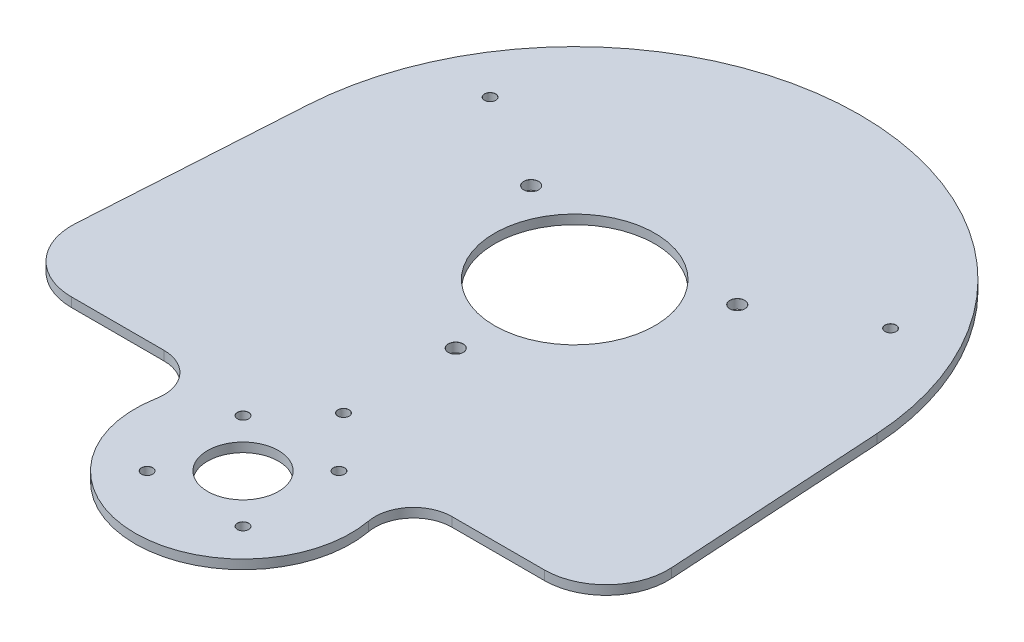
ISO-10303-21;
HEADER;
FILE_DESCRIPTION(('STEP AP214'),'2;1');
FILE_NAME('part.step','',(''),(''),'','','');
FILE_SCHEMA(('AUTOMOTIVE_DESIGN { 1 0 10303 214 1 1 1 1 }'));
ENDSEC;
DATA;
#1=APPLICATION_CONTEXT('core data for automotive mechanical design processes');
#2=APPLICATION_PROTOCOL_DEFINITION('international standard','automotive_design',2000,#1);
#3=PRODUCT_CONTEXT('',#1,'mechanical');
#4=PRODUCT('Part','Part','',(#3));
#5=PRODUCT_RELATED_PRODUCT_CATEGORY('part','',(#4));
#6=PRODUCT_DEFINITION_FORMATION('','',#4);
#7=PRODUCT_DEFINITION_CONTEXT('part definition',#1,'design');
#8=PRODUCT_DEFINITION('design','',#6,#7);
#9=PRODUCT_DEFINITION_SHAPE('','',#8);
#10=(LENGTH_UNIT() NAMED_UNIT(*) SI_UNIT(.MILLI.,.METRE.));
#11=(NAMED_UNIT(*) PLANE_ANGLE_UNIT() SI_UNIT($,.RADIAN.));
#12=(NAMED_UNIT(*) SI_UNIT($,.STERADIAN.) SOLID_ANGLE_UNIT());
#13=UNCERTAINTY_MEASURE_WITH_UNIT(LENGTH_MEASURE(1.E-05),#10,'distance_accuracy_value','');
#14=(GEOMETRIC_REPRESENTATION_CONTEXT(3) GLOBAL_UNCERTAINTY_ASSIGNED_CONTEXT((#13)) GLOBAL_UNIT_ASSIGNED_CONTEXT((#10,
#11,#12)) REPRESENTATION_CONTEXT('',''));
#15=CARTESIAN_POINT('',(0.,0.,0.));
#16=DIRECTION('',(0.,0.,1.));
#17=DIRECTION('',(1.,0.,0.));
#18=AXIS2_PLACEMENT_3D('',#15,#16,#17);
#19=CARTESIAN_POINT('',(0.,0.,0.));
#20=DIRECTION('',(0.,-1.,0.));
#21=DIRECTION('',(0.,0.,-1.));
#22=AXIS2_PLACEMENT_3D('',#19,#20,#21);
#23=PLANE('',#22);
#24=CARTESIAN_POINT('',(-64.9519052838329,0.,-37.5));
#25=DIRECTION('',(0.,1.,0.));
#26=DIRECTION('',(0.,0.,1.));
#27=AXIS2_PLACEMENT_3D('',#24,#25,#26);
#28=CIRCLE('',#27,1.82500000000001);
#29=CARTESIAN_POINT('',(-64.9519052838329,0.,-35.675));
#30=VERTEX_POINT('',#29);
#31=EDGE_CURVE('E333',#30,#30,#28,.T.);
#32=ORIENTED_EDGE('',*,*,#31,.F.);
#33=EDGE_LOOP('',(#32));
#34=FACE_BOUND('',#33,.T.);
#35=CARTESIAN_POINT('',(0.,0.,75.));
#36=DIRECTION('',(0.,1.,0.));
#37=DIRECTION('',(0.,0.,1.));
#38=AXIS2_PLACEMENT_3D('',#35,#36,#37);
#39=CIRCLE('',#38,1.825);
#40=CARTESIAN_POINT('',(0.,0.,76.825));
#41=VERTEX_POINT('',#40);
#42=EDGE_CURVE('E337',#41,#41,#39,.T.);
#43=ORIENTED_EDGE('',*,*,#42,.F.);
#44=EDGE_LOOP('',(#43));
#45=FACE_BOUND('',#44,.T.);
#46=CARTESIAN_POINT('',(64.9519052838329,0.,-37.5));
#47=DIRECTION('',(0.,1.,0.));
#48=DIRECTION('',(0.,0.,1.));
#49=AXIS2_PLACEMENT_3D('',#46,#47,#48);
#50=CIRCLE('',#49,1.82500000000001);
#51=CARTESIAN_POINT('',(64.9519052838329,0.,-35.675));
#52=VERTEX_POINT('',#51);
#53=EDGE_CURVE('E340',#52,#52,#50,.T.);
#54=ORIENTED_EDGE('',*,*,#53,.F.);
#55=EDGE_LOOP('',(#54));
#56=FACE_BOUND('',#55,.T.);
#57=DIRECTION('',(1.,0.,0.));
#58=VECTOR('',#57,1.);
#59=CARTESIAN_POINT('',(0.,0.,86.518));
#60=LINE('',#59,#58);
#61=CARTESIAN_POINT('',(-76.7182970151952,0.,86.518));
#62=VERTEX_POINT('',#61);
#63=CARTESIAN_POINT('',(-46.7182970151952,0.,86.518));
#64=VERTEX_POINT('',#63);
#65=EDGE_CURVE('E50',#62,#64,#60,.T.);
#66=ORIENTED_EDGE('',*,*,#65,.T.);
#67=CARTESIAN_POINT('',(-46.7182970151952,0.,99.018));
#68=DIRECTION('',(0.,-1.,0.));
#69=DIRECTION('',(0.,0.,-1.));
#70=AXIS2_PLACEMENT_3D('',#67,#68,#69);
#71=CIRCLE('',#70,12.5);
#72=CARTESIAN_POINT('',(-34.424008326986,0.,101.276421052632));
#73=VERTEX_POINT('',#72);
#74=EDGE_CURVE('E208',#64,#73,#71,.T.);
#75=ORIENTED_EDGE('',*,*,#74,.T.);
#76=CARTESIAN_POINT('',(0.,0.,107.6));
#77=DIRECTION('',(0.,-1.,0.));
#78=DIRECTION('',(0.,0.,-1.));
#79=AXIS2_PLACEMENT_3D('',#76,#77,#78);
#80=CIRCLE('',#79,35.);
#81=CARTESIAN_POINT('',(34.424008326986,0.,101.276421052632));
#82=VERTEX_POINT('',#81);
#83=EDGE_CURVE('E205',#82,#73,#80,.T.);
#84=ORIENTED_EDGE('',*,*,#83,.F.);
#85=CARTESIAN_POINT('',(46.7182970151952,0.,99.018));
#86=DIRECTION('',(0.,-1.,0.));
#87=DIRECTION('',(0.,0.,-1.));
#88=AXIS2_PLACEMENT_3D('',#85,#86,#87);
#89=CIRCLE('',#88,12.5);
#90=CARTESIAN_POINT('',(46.7182970151952,0.,86.518));
#91=VERTEX_POINT('',#90);
#92=EDGE_CURVE('E202',#82,#91,#89,.T.);
#93=ORIENTED_EDGE('',*,*,#92,.T.);
#94=DIRECTION('',(1.,0.,0.));
#95=VECTOR('',#94,1.);
#96=CARTESIAN_POINT('',(0.,0.,86.518));
#97=LINE('',#96,#95);
#98=CARTESIAN_POINT('',(76.7182970151952,0.,86.518));
#99=VERTEX_POINT('',#98);
#100=EDGE_CURVE('E206',#91,#99,#97,.T.);
#101=ORIENTED_EDGE('',*,*,#100,.T.);
#102=CARTESIAN_POINT('',(76.7182970151952,0.,66.518));
#103=DIRECTION('',(0.,1.,0.));
#104=DIRECTION('',(0.,0.,1.));
#105=AXIS2_PLACEMENT_3D('',#102,#103,#104);
#106=CIRCLE('',#105,20.);
#107=CARTESIAN_POINT('',(96.680745663774,0.,65.2929922641653));
#108=VERTEX_POINT('',#107);
#109=EDGE_CURVE('E292',#99,#108,#106,.T.);
#110=ORIENTED_EDGE('',*,*,#109,.T.);
#111=DIRECTION('',(0.0612503867917331,0.,0.99812243242894));
#112=VECTOR('',#111,1.);
#113=CARTESIAN_POINT('',(92.3263249996769,0.,-5.66566077823532));
#114=LINE('',#113,#112);
#115=CARTESIAN_POINT('',(92.3263249996769,0.,-5.66566077823532));
#116=VERTEX_POINT('',#115);
#117=EDGE_CURVE('E289',#108,#116,#114,.F.);
#118=ORIENTED_EDGE('',*,*,#117,.T.);
#119=CARTESIAN_POINT('',(0.,0.,0.));
#120=DIRECTION('',(0.,1.,0.));
#121=DIRECTION('',(0.,0.,1.));
#122=AXIS2_PLACEMENT_3D('',#119,#120,#121);
#123=CIRCLE('',#122,92.5);
#124=CARTESIAN_POINT('',(-92.3263249996769,0.,-5.66566077823532));
#125=VERTEX_POINT('',#124);
#126=EDGE_CURVE('E286',#116,#125,#123,.T.);
#127=ORIENTED_EDGE('',*,*,#126,.T.);
#128=DIRECTION('',(0.0612503867917331,0.,-0.99812243242894));
#129=VECTOR('',#128,1.);
#130=CARTESIAN_POINT('',(-92.3263249996769,0.,-5.66566077823531));
#131=LINE('',#130,#129);
#132=CARTESIAN_POINT('',(-96.680745663774,0.,65.2929922641653));
#133=VERTEX_POINT('',#132);
#134=EDGE_CURVE('E284',#133,#125,#131,.T.);
#135=ORIENTED_EDGE('',*,*,#134,.F.);
#136=CARTESIAN_POINT('',(-76.7182970151952,0.,66.518));
#137=DIRECTION('',(0.,1.,0.));
#138=DIRECTION('',(0.,0.,1.));
#139=AXIS2_PLACEMENT_3D('',#136,#137,#138);
#140=CIRCLE('',#139,20.);
#141=EDGE_CURVE('E189',#62,#133,#140,.F.);
#142=ORIENTED_EDGE('',*,*,#141,.F.);
#143=EDGE_LOOP('',(#66,#75,#84,#93,#101,#110,#118,#127,#135,#142));
#144=FACE_BOUND('',#143,.T.);
#145=CARTESIAN_POINT('',(-15.556349186104,0.,92.043650813896));
#146=DIRECTION('',(0.,1.,0.));
#147=DIRECTION('',(0.,0.,1.));
#148=AXIS2_PLACEMENT_3D('',#145,#146,#147);
#149=CIRCLE('',#148,1.825);
#150=CARTESIAN_POINT('',(-15.556349186104,0.,93.868650813896));
#151=VERTEX_POINT('',#150);
#152=EDGE_CURVE('E220',#151,#151,#149,.T.);
#153=ORIENTED_EDGE('',*,*,#152,.F.);
#154=EDGE_LOOP('',(#153));
#155=FACE_BOUND('',#154,.T.);
#156=CARTESIAN_POINT('',(-15.556349186104,0.,123.156349186104));
#157=DIRECTION('',(0.,1.,0.));
#158=DIRECTION('',(0.,0.,1.));
#159=AXIS2_PLACEMENT_3D('',#156,#157,#158);
#160=CIRCLE('',#159,1.825);
#161=CARTESIAN_POINT('',(-15.556349186104,0.,124.981349186104));
#162=VERTEX_POINT('',#161);
#163=EDGE_CURVE('E229',#162,#162,#160,.T.);
#164=ORIENTED_EDGE('',*,*,#163,.F.);
#165=EDGE_LOOP('',(#164));
#166=FACE_BOUND('',#165,.T.);
#167=CARTESIAN_POINT('',(0.,0.,38.6));
#168=DIRECTION('',(0.,1.,0.));
#169=DIRECTION('',(0.,0.,1.));
#170=AXIS2_PLACEMENT_3D('',#167,#168,#169);
#171=CIRCLE('',#170,2.425);
#172=CARTESIAN_POINT('',(0.,0.,41.025));
#173=VERTEX_POINT('',#172);
#174=EDGE_CURVE('E247',#173,#173,#171,.T.);
#175=ORIENTED_EDGE('',*,*,#174,.F.);
#176=EDGE_LOOP('',(#175));
#177=FACE_BOUND('',#176,.T.);
#178=CARTESIAN_POINT('',(33.4285805860793,0.,-19.3));
#179=DIRECTION('',(0.,1.,0.));
#180=DIRECTION('',(0.,0.,1.));
#181=AXIS2_PLACEMENT_3D('',#178,#179,#180);
#182=CIRCLE('',#181,2.425);
#183=CARTESIAN_POINT('',(33.4285805860793,0.,-16.875));
#184=VERTEX_POINT('',#183);
#185=EDGE_CURVE('E256',#184,#184,#182,.T.);
#186=ORIENTED_EDGE('',*,*,#185,.F.);
#187=EDGE_LOOP('',(#186));
#188=FACE_BOUND('',#187,.T.);
#189=CARTESIAN_POINT('',(-33.4285805860793,0.,-19.3));
#190=DIRECTION('',(0.,1.,0.));
#191=DIRECTION('',(0.,0.,1.));
#192=AXIS2_PLACEMENT_3D('',#189,#190,#191);
#193=CIRCLE('',#192,2.425);
#194=CARTESIAN_POINT('',(-33.4285805860793,0.,-16.875));
#195=VERTEX_POINT('',#194);
#196=EDGE_CURVE('E265',#195,#195,#193,.T.);
#197=ORIENTED_EDGE('',*,*,#196,.F.);
#198=EDGE_LOOP('',(#197));
#199=FACE_BOUND('',#198,.T.);
#200=CARTESIAN_POINT('',(0.,0.,107.6));
#201=DIRECTION('',(0.,1.,0.));
#202=DIRECTION('',(0.,0.,1.));
#203=AXIS2_PLACEMENT_3D('',#200,#201,#202);
#204=CIRCLE('',#203,11.5);
#205=CARTESIAN_POINT('',(0.,0.,119.1));
#206=VERTEX_POINT('',#205);
#207=EDGE_CURVE('E274',#206,#206,#204,.T.);
#208=ORIENTED_EDGE('',*,*,#207,.F.);
#209=EDGE_LOOP('',(#208));
#210=FACE_BOUND('',#209,.T.);
#211=CARTESIAN_POINT('',(0.,0.,0.));
#212=DIRECTION('',(0.,1.,0.));
#213=DIRECTION('',(0.,0.,1.));
#214=AXIS2_PLACEMENT_3D('',#211,#212,#213);
#215=CIRCLE('',#214,26.);
#216=CARTESIAN_POINT('',(0.,0.,26.));
#217=VERTEX_POINT('',#216);
#218=EDGE_CURVE('E56',#217,#217,#215,.T.);
#219=ORIENTED_EDGE('',*,*,#218,.F.);
#220=EDGE_LOOP('',(#219));
#221=FACE_BOUND('',#220,.T.);
#222=CARTESIAN_POINT('',(15.5563491861041,0.,123.156349186104));
#223=DIRECTION('',(0.,1.,0.));
#224=DIRECTION('',(0.,0.,1.));
#225=AXIS2_PLACEMENT_3D('',#222,#223,#224);
#226=CIRCLE('',#225,1.825);
#227=CARTESIAN_POINT('',(15.5563491861041,0.,124.981349186104));
#228=VERTEX_POINT('',#227);
#229=EDGE_CURVE('E238',#228,#228,#226,.T.);
#230=ORIENTED_EDGE('',*,*,#229,.F.);
#231=EDGE_LOOP('',(#230));
#232=FACE_BOUND('',#231,.T.);
#233=CARTESIAN_POINT('',(15.5563491861041,0.,92.043650813896));
#234=DIRECTION('',(0.,1.,0.));
#235=DIRECTION('',(0.,0.,1.));
#236=AXIS2_PLACEMENT_3D('',#233,#234,#235);
#237=CIRCLE('',#236,1.825);
#238=CARTESIAN_POINT('',(15.5563491861041,0.,93.868650813896));
#239=VERTEX_POINT('',#238);
#240=EDGE_CURVE('E211',#239,#239,#237,.T.);
#241=ORIENTED_EDGE('',*,*,#240,.F.);
#242=EDGE_LOOP('',(#241));
#243=FACE_BOUND('',#242,.T.);
#244=ADVANCED_FACE('F47',(#34,#45,#56,#144,#155,#166,#177,#188,#199,#210,#221,#232,#243),#23,.F.);
#245=CARTESIAN_POINT('',(0.,-3.,0.));
#246=DIRECTION('',(0.,-1.,0.));
#247=DIRECTION('',(0.,0.,-1.));
#248=AXIS2_PLACEMENT_3D('',#245,#246,#247);
#249=PLANE('',#248);
#250=CARTESIAN_POINT('',(-64.9519052838329,-3.,-37.5));
#251=DIRECTION('',(0.,1.,0.));
#252=DIRECTION('',(0.,0.,1.));
#253=AXIS2_PLACEMENT_3D('',#250,#251,#252);
#254=CIRCLE('',#253,1.8);
#255=CARTESIAN_POINT('',(-64.9519052838329,-3.,-35.7));
#256=VERTEX_POINT('',#255);
#257=EDGE_CURVE('E353',#256,#256,#254,.T.);
#258=ORIENTED_EDGE('',*,*,#257,.T.);
#259=EDGE_LOOP('',(#258));
#260=FACE_BOUND('',#259,.T.);
#261=CARTESIAN_POINT('',(0.,-3.,75.));
#262=DIRECTION('',(0.,1.,0.));
#263=DIRECTION('',(0.,0.,1.));
#264=AXIS2_PLACEMENT_3D('',#261,#262,#263);
#265=CIRCLE('',#264,1.8);
#266=CARTESIAN_POINT('',(0.,-3.,76.8));
#267=VERTEX_POINT('',#266);
#268=EDGE_CURVE('E342',#267,#267,#265,.T.);
#269=ORIENTED_EDGE('',*,*,#268,.T.);
#270=EDGE_LOOP('',(#269));
#271=FACE_BOUND('',#270,.T.);
#272=CARTESIAN_POINT('',(64.9519052838329,-3.,-37.5));
#273=DIRECTION('',(0.,1.,0.));
#274=DIRECTION('',(0.,0.,1.));
#275=AXIS2_PLACEMENT_3D('',#272,#273,#274);
#276=CIRCLE('',#275,1.8);
#277=CARTESIAN_POINT('',(64.9519052838329,-3.,-35.7));
#278=VERTEX_POINT('',#277);
#279=EDGE_CURVE('E149',#278,#278,#276,.T.);
#280=ORIENTED_EDGE('',*,*,#279,.T.);
#281=EDGE_LOOP('',(#280));
#282=FACE_BOUND('',#281,.T.);
#283=CARTESIAN_POINT('',(-46.7182970151952,-3.,99.018));
#284=DIRECTION('',(0.,1.,0.));
#285=DIRECTION('',(0.,0.,1.));
#286=AXIS2_PLACEMENT_3D('',#283,#284,#285);
#287=CIRCLE('',#286,12.5);
#288=CARTESIAN_POINT('',(-34.424008326986,-3.,101.276421052632));
#289=VERTEX_POINT('',#288);
#290=CARTESIAN_POINT('',(-46.7182970151952,-3.,86.518));
#291=VERTEX_POINT('',#290);
#292=EDGE_CURVE('E131',#289,#291,#287,.T.);
#293=ORIENTED_EDGE('',*,*,#292,.T.);
#294=DIRECTION('',(1.,0.,0.));
#295=VECTOR('',#294,1.);
#296=CARTESIAN_POINT('',(0.,-3.,86.518));
#297=LINE('',#296,#295);
#298=CARTESIAN_POINT('',(-76.7182970151952,-3.,86.518));
#299=VERTEX_POINT('',#298);
#300=EDGE_CURVE('E125',#299,#291,#297,.T.);
#301=ORIENTED_EDGE('',*,*,#300,.F.);
#302=CARTESIAN_POINT('',(-76.7182970151952,-3.,66.518));
#303=DIRECTION('',(0.,1.,0.));
#304=DIRECTION('',(0.,0.,1.));
#305=AXIS2_PLACEMENT_3D('',#302,#303,#304);
#306=CIRCLE('',#305,20.);
#307=CARTESIAN_POINT('',(-96.680745663774,-3.,65.2929922641653));
#308=VERTEX_POINT('',#307);
#309=EDGE_CURVE('E135',#299,#308,#306,.F.);
#310=ORIENTED_EDGE('',*,*,#309,.T.);
#311=DIRECTION('',(0.0612503867917331,0.,-0.99812243242894));
#312=VECTOR('',#311,1.);
#313=CARTESIAN_POINT('',(-92.3263249996769,-3.,-5.66566077823531));
#314=LINE('',#313,#312);
#315=CARTESIAN_POINT('',(-92.3263249996769,-3.,-5.66566077823533));
#316=VERTEX_POINT('',#315);
#317=EDGE_CURVE('E141',#308,#316,#314,.T.);
#318=ORIENTED_EDGE('',*,*,#317,.T.);
#319=CARTESIAN_POINT('',(0.,-3.,0.));
#320=DIRECTION('',(0.,1.,0.));
#321=DIRECTION('',(0.,0.,1.));
#322=AXIS2_PLACEMENT_3D('',#319,#320,#321);
#323=CIRCLE('',#322,92.5);
#324=CARTESIAN_POINT('',(92.3263249996769,-3.,-5.66566077823533));
#325=VERTEX_POINT('',#324);
#326=EDGE_CURVE('E172',#325,#316,#323,.T.);
#327=ORIENTED_EDGE('',*,*,#326,.F.);
#328=DIRECTION('',(-0.0612503867917331,0.,-0.99812243242894));
#329=VECTOR('',#328,1.);
#330=CARTESIAN_POINT('',(92.3263249996769,-3.,-5.66566077823531));
#331=LINE('',#330,#329);
#332=CARTESIAN_POINT('',(96.680745663774,-3.,65.2929922641653));
#333=VERTEX_POINT('',#332);
#334=EDGE_CURVE('E166',#333,#325,#331,.T.);
#335=ORIENTED_EDGE('',*,*,#334,.F.);
#336=CARTESIAN_POINT('',(76.7182970151952,-3.,66.518));
#337=DIRECTION('',(0.,1.,0.));
#338=DIRECTION('',(0.,0.,1.));
#339=AXIS2_PLACEMENT_3D('',#336,#337,#338);
#340=CIRCLE('',#339,20.);
#341=CARTESIAN_POINT('',(76.7182970151952,-3.,86.518));
#342=VERTEX_POINT('',#341);
#343=EDGE_CURVE('E158',#342,#333,#340,.T.);
#344=ORIENTED_EDGE('',*,*,#343,.F.);
#345=CARTESIAN_POINT('',(46.7182970151952,-3.,86.518));
#346=VERTEX_POINT('',#345);
#347=EDGE_CURVE('E151',#346,#342,#297,.T.);
#348=ORIENTED_EDGE('',*,*,#347,.F.);
#349=CARTESIAN_POINT('',(46.7182970151952,-3.,99.018));
#350=DIRECTION('',(0.,1.,0.));
#351=DIRECTION('',(0.,0.,1.));
#352=AXIS2_PLACEMENT_3D('',#349,#350,#351);
#353=CIRCLE('',#352,12.5);
#354=CARTESIAN_POINT('',(34.424008326986,-3.,101.276421052632));
#355=VERTEX_POINT('',#354);
#356=EDGE_CURVE('E157',#346,#355,#353,.T.);
#357=ORIENTED_EDGE('',*,*,#356,.T.);
#358=CARTESIAN_POINT('',(0.,-3.,107.6));
#359=DIRECTION('',(0.,1.,0.));
#360=DIRECTION('',(0.,0.,1.));
#361=AXIS2_PLACEMENT_3D('',#358,#359,#360);
#362=CIRCLE('',#361,35.);
#363=EDGE_CURVE('E164',#289,#355,#362,.T.);
#364=ORIENTED_EDGE('',*,*,#363,.F.);
#365=EDGE_LOOP('',(#293,#301,#310,#318,#327,#335,#344,#348,#357,#364));
#366=FACE_BOUND('',#365,.T.);
#367=CARTESIAN_POINT('',(15.5563491861041,-3.,92.043650813896));
#368=DIRECTION('',(0.,1.,0.));
#369=DIRECTION('',(0.,0.,1.));
#370=AXIS2_PLACEMENT_3D('',#367,#368,#369);
#371=CIRCLE('',#370,1.8);
#372=CARTESIAN_POINT('',(15.5563491861041,-3.,93.8436508138959));
#373=VERTEX_POINT('',#372);
#374=EDGE_CURVE('E217',#373,#373,#371,.T.);
#375=ORIENTED_EDGE('',*,*,#374,.T.);
#376=EDGE_LOOP('',(#375));
#377=FACE_BOUND('',#376,.T.);
#378=CARTESIAN_POINT('',(-15.556349186104,-3.,92.043650813896));
#379=DIRECTION('',(0.,1.,0.));
#380=DIRECTION('',(0.,0.,1.));
#381=AXIS2_PLACEMENT_3D('',#378,#379,#380);
#382=CIRCLE('',#381,1.8);
#383=CARTESIAN_POINT('',(-15.556349186104,-3.,93.8436508138959));
#384=VERTEX_POINT('',#383);
#385=EDGE_CURVE('E226',#384,#384,#382,.T.);
#386=ORIENTED_EDGE('',*,*,#385,.T.);
#387=EDGE_LOOP('',(#386));
#388=FACE_BOUND('',#387,.T.);
#389=CARTESIAN_POINT('',(-15.556349186104,-3.,123.156349186104));
#390=DIRECTION('',(0.,1.,0.));
#391=DIRECTION('',(0.,0.,1.));
#392=AXIS2_PLACEMENT_3D('',#389,#390,#391);
#393=CIRCLE('',#392,1.8);
#394=CARTESIAN_POINT('',(-15.556349186104,-3.,124.956349186104));
#395=VERTEX_POINT('',#394);
#396=EDGE_CURVE('E235',#395,#395,#393,.T.);
#397=ORIENTED_EDGE('',*,*,#396,.T.);
#398=EDGE_LOOP('',(#397));
#399=FACE_BOUND('',#398,.T.);
#400=CARTESIAN_POINT('',(15.5563491861041,-3.,123.156349186104));
#401=DIRECTION('',(0.,1.,0.));
#402=DIRECTION('',(0.,0.,1.));
#403=AXIS2_PLACEMENT_3D('',#400,#401,#402);
#404=CIRCLE('',#403,1.8);
#405=CARTESIAN_POINT('',(15.5563491861041,-3.,124.956349186104));
#406=VERTEX_POINT('',#405);
#407=EDGE_CURVE('E244',#406,#406,#404,.T.);
#408=ORIENTED_EDGE('',*,*,#407,.T.);
#409=EDGE_LOOP('',(#408));
#410=FACE_BOUND('',#409,.T.);
#411=CARTESIAN_POINT('',(0.,-3.,38.6));
#412=DIRECTION('',(0.,1.,0.));
#413=DIRECTION('',(0.,0.,1.));
#414=AXIS2_PLACEMENT_3D('',#411,#412,#413);
#415=CIRCLE('',#414,2.4);
#416=CARTESIAN_POINT('',(0.,-3.,41.));
#417=VERTEX_POINT('',#416);
#418=EDGE_CURVE('E253',#417,#417,#415,.T.);
#419=ORIENTED_EDGE('',*,*,#418,.T.);
#420=EDGE_LOOP('',(#419));
#421=FACE_BOUND('',#420,.T.);
#422=CARTESIAN_POINT('',(33.4285805860793,-3.,-19.3));
#423=DIRECTION('',(0.,1.,0.));
#424=DIRECTION('',(0.,0.,1.));
#425=AXIS2_PLACEMENT_3D('',#422,#423,#424);
#426=CIRCLE('',#425,2.4);
#427=CARTESIAN_POINT('',(33.4285805860793,-3.,-16.9));
#428=VERTEX_POINT('',#427);
#429=EDGE_CURVE('E262',#428,#428,#426,.T.);
#430=ORIENTED_EDGE('',*,*,#429,.T.);
#431=EDGE_LOOP('',(#430));
#432=FACE_BOUND('',#431,.T.);
#433=CARTESIAN_POINT('',(-33.4285805860793,-3.,-19.3));
#434=DIRECTION('',(0.,1.,0.));
#435=DIRECTION('',(0.,0.,1.));
#436=AXIS2_PLACEMENT_3D('',#433,#434,#435);
#437=CIRCLE('',#436,2.4);
#438=CARTESIAN_POINT('',(-33.4285805860793,-3.,-16.9));
#439=VERTEX_POINT('',#438);
#440=EDGE_CURVE('E271',#439,#439,#437,.T.);
#441=ORIENTED_EDGE('',*,*,#440,.T.);
#442=EDGE_LOOP('',(#441));
#443=FACE_BOUND('',#442,.T.);
#444=CARTESIAN_POINT('',(0.,-3.,107.6));
#445=DIRECTION('',(0.,-1.,0.));
#446=DIRECTION('',(0.,0.,-1.));
#447=AXIS2_PLACEMENT_3D('',#444,#445,#446);
#448=CIRCLE('',#447,11.5);
#449=CARTESIAN_POINT('',(0.,-3.,96.1));
#450=VERTEX_POINT('',#449);
#451=EDGE_CURVE('E277',#450,#450,#448,.T.);
#452=ORIENTED_EDGE('',*,*,#451,.F.);
#453=EDGE_LOOP('',(#452));
#454=FACE_BOUND('',#453,.T.);
#455=CARTESIAN_POINT('',(0.,-3.,0.));
#456=DIRECTION('',(0.,-1.,0.));
#457=DIRECTION('',(0.,0.,-1.));
#458=AXIS2_PLACEMENT_3D('',#455,#456,#457);
#459=CIRCLE('',#458,26.);
#460=CARTESIAN_POINT('',(0.,-3.,-26.));
#461=VERTEX_POINT('',#460);
#462=EDGE_CURVE('E11',#461,#461,#459,.T.);
#463=ORIENTED_EDGE('',*,*,#462,.F.);
#464=EDGE_LOOP('',(#463));
#465=FACE_BOUND('',#464,.T.);
#466=ADVANCED_FACE('F144',(#260,#271,#282,#366,#377,#388,#399,#410,#421,#432,#443,#454,#465),
#249,.T.);
#467=CARTESIAN_POINT('',(0.,0.,0.));
#468=DIRECTION('',(0.,1.,0.));
#469=DIRECTION('',(0.,0.,1.));
#470=AXIS2_PLACEMENT_3D('',#467,#468,#469);
#471=CYLINDRICAL_SURFACE('',#470,26.);
#472=ORIENTED_EDGE('',*,*,#462,.T.);
#473=EDGE_LOOP('',(#472));
#474=FACE_BOUND('',#473,.T.);
#475=ORIENTED_EDGE('',*,*,#218,.T.);
#476=EDGE_LOOP('',(#475));
#477=FACE_BOUND('',#476,.T.);
#478=ADVANCED_FACE('F328',(#474,#477),#471,.F.);
#479=CARTESIAN_POINT('',(0.,0.,107.6));
#480=DIRECTION('',(0.,1.,0.));
#481=DIRECTION('',(0.,0.,1.));
#482=AXIS2_PLACEMENT_3D('',#479,#480,#481);
#483=CYLINDRICAL_SURFACE('',#482,11.5);
#484=ORIENTED_EDGE('',*,*,#451,.T.);
#485=EDGE_LOOP('',(#484));
#486=FACE_BOUND('',#485,.T.);
#487=ORIENTED_EDGE('',*,*,#207,.T.);
#488=EDGE_LOOP('',(#487));
#489=FACE_BOUND('',#488,.T.);
#490=ADVANCED_FACE('F669',(#486,#489),#483,.F.);
#491=CARTESIAN_POINT('',(-33.4285805860793,0.,-19.3));
#492=DIRECTION('',(0.,1.,0.));
#493=DIRECTION('',(0.,0.,1.));
#494=AXIS2_PLACEMENT_3D('',#491,#492,#493);
#495=CYLINDRICAL_SURFACE('',#494,2.4);
#496=ORIENTED_EDGE('',*,*,#440,.F.);
#497=EDGE_LOOP('',(#496));
#498=FACE_BOUND('',#497,.T.);
#499=CARTESIAN_POINT('',(-33.4285805860793,-0.0249999999999998,-19.3));
#500=DIRECTION('',(0.,1.,0.));
#501=DIRECTION('',(0.,0.,1.));
#502=AXIS2_PLACEMENT_3D('',#499,#500,#501);
#503=CIRCLE('',#502,2.4);
#504=CARTESIAN_POINT('',(-33.4285805860793,-0.0249999999999998,-16.9));
#505=VERTEX_POINT('',#504);
#506=EDGE_CURVE('E268',#505,#505,#503,.T.);
#507=ORIENTED_EDGE('',*,*,#506,.T.);
#508=EDGE_LOOP('',(#507));
#509=FACE_BOUND('',#508,.T.);
#510=ADVANCED_FACE('F659',(#498,#509),#495,.F.);
#511=CARTESIAN_POINT('',(-33.4285805860793,0.,-19.3));
#512=DIRECTION('',(0.,1.,0.));
#513=DIRECTION('',(0.,0.,1.));
#514=AXIS2_PLACEMENT_3D('',#511,#512,#513);
#515=CONICAL_SURFACE('',#514,2.425,0.785398163397466);
#516=ORIENTED_EDGE('',*,*,#506,.F.);
#517=EDGE_LOOP('',(#516));
#518=FACE_BOUND('',#517,.T.);
#519=ORIENTED_EDGE('',*,*,#196,.T.);
#520=EDGE_LOOP('',(#519));
#521=FACE_BOUND('',#520,.T.);
#522=ADVANCED_FACE('F649',(#518,#521),#515,.F.);
#523=CARTESIAN_POINT('',(33.4285805860793,0.,-19.3));
#524=DIRECTION('',(0.,1.,0.));
#525=DIRECTION('',(0.,0.,1.));
#526=AXIS2_PLACEMENT_3D('',#523,#524,#525);
#527=CYLINDRICAL_SURFACE('',#526,2.4);
#528=ORIENTED_EDGE('',*,*,#429,.F.);
#529=EDGE_LOOP('',(#528));
#530=FACE_BOUND('',#529,.T.);
#531=CARTESIAN_POINT('',(33.4285805860793,-0.0249999999999998,-19.3));
#532=DIRECTION('',(0.,1.,0.));
#533=DIRECTION('',(0.,0.,1.));
#534=AXIS2_PLACEMENT_3D('',#531,#532,#533);
#535=CIRCLE('',#534,2.4);
#536=CARTESIAN_POINT('',(33.4285805860793,-0.0249999999999998,-16.9));
#537=VERTEX_POINT('',#536);
#538=EDGE_CURVE('E259',#537,#537,#535,.T.);
#539=ORIENTED_EDGE('',*,*,#538,.T.);
#540=EDGE_LOOP('',(#539));
#541=FACE_BOUND('',#540,.T.);
#542=ADVANCED_FACE('F639',(#530,#541),#527,.F.);
#543=CARTESIAN_POINT('',(33.4285805860793,0.,-19.3));
#544=DIRECTION('',(0.,1.,0.));
#545=DIRECTION('',(0.,0.,1.));
#546=AXIS2_PLACEMENT_3D('',#543,#544,#545);
#547=CONICAL_SURFACE('',#546,2.425,0.785398163397535);
#548=ORIENTED_EDGE('',*,*,#538,.F.);
#549=EDGE_LOOP('',(#548));
#550=FACE_BOUND('',#549,.T.);
#551=ORIENTED_EDGE('',*,*,#185,.T.);
#552=EDGE_LOOP('',(#551));
#553=FACE_BOUND('',#552,.T.);
#554=ADVANCED_FACE('F629',(#550,#553),#547,.F.);
#555=CARTESIAN_POINT('',(0.,0.,38.6));
#556=DIRECTION('',(0.,1.,0.));
#557=DIRECTION('',(0.,0.,1.));
#558=AXIS2_PLACEMENT_3D('',#555,#556,#557);
#559=CYLINDRICAL_SURFACE('',#558,2.4);
#560=ORIENTED_EDGE('',*,*,#418,.F.);
#561=EDGE_LOOP('',(#560));
#562=FACE_BOUND('',#561,.T.);
#563=CARTESIAN_POINT('',(0.,-0.0249999999999998,38.6));
#564=DIRECTION('',(0.,1.,0.));
#565=DIRECTION('',(0.,0.,1.));
#566=AXIS2_PLACEMENT_3D('',#563,#564,#565);
#567=CIRCLE('',#566,2.4);
#568=CARTESIAN_POINT('',(0.,-0.0249999999999998,41.));
#569=VERTEX_POINT('',#568);
#570=EDGE_CURVE('E250',#569,#569,#567,.T.);
#571=ORIENTED_EDGE('',*,*,#570,.T.);
#572=EDGE_LOOP('',(#571));
#573=FACE_BOUND('',#572,.T.);
#574=ADVANCED_FACE('F619',(#562,#573),#559,.F.);
#575=CARTESIAN_POINT('',(0.,0.,38.6));
#576=DIRECTION('',(0.,1.,0.));
#577=DIRECTION('',(0.,0.,1.));
#578=AXIS2_PLACEMENT_3D('',#575,#576,#577);
#579=CONICAL_SURFACE('',#578,2.425,0.785398163397457);
#580=ORIENTED_EDGE('',*,*,#570,.F.);
#581=EDGE_LOOP('',(#580));
#582=FACE_BOUND('',#581,.T.);
#583=ORIENTED_EDGE('',*,*,#174,.T.);
#584=EDGE_LOOP('',(#583));
#585=FACE_BOUND('',#584,.T.);
#586=ADVANCED_FACE('F608',(#582,#585),#579,.F.);
#587=CARTESIAN_POINT('',(15.5563491861041,0.,123.156349186104));
#588=DIRECTION('',(0.,1.,0.));
#589=DIRECTION('',(0.,0.,1.));
#590=AXIS2_PLACEMENT_3D('',#587,#588,#589);
#591=CYLINDRICAL_SURFACE('',#590,1.8);
#592=ORIENTED_EDGE('',*,*,#407,.F.);
#593=EDGE_LOOP('',(#592));
#594=FACE_BOUND('',#593,.T.);
#595=CARTESIAN_POINT('',(15.5563491861041,-0.024999999999999,123.156349186104));
#596=DIRECTION('',(0.,1.,0.));
#597=DIRECTION('',(0.,0.,1.));
#598=AXIS2_PLACEMENT_3D('',#595,#596,#597);
#599=CIRCLE('',#598,1.8);
#600=CARTESIAN_POINT('',(15.5563491861041,-0.024999999999999,124.956349186104));
#601=VERTEX_POINT('',#600);
#602=EDGE_CURVE('E241',#601,#601,#599,.T.);
#603=ORIENTED_EDGE('',*,*,#602,.T.);
#604=EDGE_LOOP('',(#603));
#605=FACE_BOUND('',#604,.T.);
#606=ADVANCED_FACE('F600',(#594,#605),#591,.F.);
#607=CARTESIAN_POINT('',(15.5563491861041,0.,123.156349186104));
#608=DIRECTION('',(0.,1.,0.));
#609=DIRECTION('',(0.,0.,1.));
#610=AXIS2_PLACEMENT_3D('',#607,#608,#609);
#611=CONICAL_SURFACE('',#610,1.825,0.785398163397483);
#612=ORIENTED_EDGE('',*,*,#602,.F.);
#613=EDGE_LOOP('',(#612));
#614=FACE_BOUND('',#613,.T.);
#615=ORIENTED_EDGE('',*,*,#229,.T.);
#616=EDGE_LOOP('',(#615));
#617=FACE_BOUND('',#616,.T.);
#618=ADVANCED_FACE('F590',(#614,#617),#611,.F.);
#619=CARTESIAN_POINT('',(-15.556349186104,0.,123.156349186104));
#620=DIRECTION('',(0.,1.,0.));
#621=DIRECTION('',(0.,0.,1.));
#622=AXIS2_PLACEMENT_3D('',#619,#620,#621);
#623=CYLINDRICAL_SURFACE('',#622,1.8);
#624=ORIENTED_EDGE('',*,*,#396,.F.);
#625=EDGE_LOOP('',(#624));
#626=FACE_BOUND('',#625,.T.);
#627=CARTESIAN_POINT('',(-15.556349186104,-0.024999999999999,123.156349186104));
#628=DIRECTION('',(0.,1.,0.));
#629=DIRECTION('',(0.,0.,1.));
#630=AXIS2_PLACEMENT_3D('',#627,#628,#629);
#631=CIRCLE('',#630,1.8);
#632=CARTESIAN_POINT('',(-15.556349186104,-0.024999999999999,124.956349186104));
#633=VERTEX_POINT('',#632);
#634=EDGE_CURVE('E232',#633,#633,#631,.T.);
#635=ORIENTED_EDGE('',*,*,#634,.T.);
#636=EDGE_LOOP('',(#635));
#637=FACE_BOUND('',#636,.T.);
#638=ADVANCED_FACE('F580',(#626,#637),#623,.F.);
#639=CARTESIAN_POINT('',(-15.556349186104,0.,123.156349186104));
#640=DIRECTION('',(0.,1.,0.));
#641=DIRECTION('',(0.,0.,1.));
#642=AXIS2_PLACEMENT_3D('',#639,#640,#641);
#643=CONICAL_SURFACE('',#642,1.825,0.785398163397483);
#644=ORIENTED_EDGE('',*,*,#634,.F.);
#645=EDGE_LOOP('',(#644));
#646=FACE_BOUND('',#645,.T.);
#647=ORIENTED_EDGE('',*,*,#163,.T.);
#648=EDGE_LOOP('',(#647));
#649=FACE_BOUND('',#648,.T.);
#650=ADVANCED_FACE('F570',(#646,#649),#643,.F.);
#651=CARTESIAN_POINT('',(-15.556349186104,0.,92.043650813896));
#652=DIRECTION('',(0.,1.,0.));
#653=DIRECTION('',(0.,0.,1.));
#654=AXIS2_PLACEMENT_3D('',#651,#652,#653);
#655=CYLINDRICAL_SURFACE('',#654,1.8);
#656=ORIENTED_EDGE('',*,*,#385,.F.);
#657=EDGE_LOOP('',(#656));
#658=FACE_BOUND('',#657,.T.);
#659=CARTESIAN_POINT('',(-15.556349186104,-0.024999999999999,92.043650813896));
#660=DIRECTION('',(0.,1.,0.));
#661=DIRECTION('',(0.,0.,1.));
#662=AXIS2_PLACEMENT_3D('',#659,#660,#661);
#663=CIRCLE('',#662,1.8);
#664=CARTESIAN_POINT('',(-15.556349186104,-0.024999999999999,93.8436508138959));
#665=VERTEX_POINT('',#664);
#666=EDGE_CURVE('E223',#665,#665,#663,.T.);
#667=ORIENTED_EDGE('',*,*,#666,.T.);
#668=EDGE_LOOP('',(#667));
#669=FACE_BOUND('',#668,.T.);
#670=ADVANCED_FACE('F560',(#658,#669),#655,.F.);
#671=CARTESIAN_POINT('',(-15.556349186104,0.,92.043650813896));
#672=DIRECTION('',(0.,1.,0.));
#673=DIRECTION('',(0.,0.,1.));
#674=AXIS2_PLACEMENT_3D('',#671,#672,#673);
#675=CONICAL_SURFACE('',#674,1.825,0.785398163397483);
#676=ORIENTED_EDGE('',*,*,#666,.F.);
#677=EDGE_LOOP('',(#676));
#678=FACE_BOUND('',#677,.T.);
#679=ORIENTED_EDGE('',*,*,#152,.T.);
#680=EDGE_LOOP('',(#679));
#681=FACE_BOUND('',#680,.T.);
#682=ADVANCED_FACE('F550',(#678,#681),#675,.F.);
#683=CARTESIAN_POINT('',(15.5563491861041,0.,92.043650813896));
#684=DIRECTION('',(0.,1.,0.));
#685=DIRECTION('',(0.,0.,1.));
#686=AXIS2_PLACEMENT_3D('',#683,#684,#685);
#687=CYLINDRICAL_SURFACE('',#686,1.8);
#688=ORIENTED_EDGE('',*,*,#374,.F.);
#689=EDGE_LOOP('',(#688));
#690=FACE_BOUND('',#689,.T.);
#691=CARTESIAN_POINT('',(15.5563491861041,-0.024999999999999,92.043650813896));
#692=DIRECTION('',(0.,1.,0.));
#693=DIRECTION('',(0.,0.,1.));
#694=AXIS2_PLACEMENT_3D('',#691,#692,#693);
#695=CIRCLE('',#694,1.8);
#696=CARTESIAN_POINT('',(15.5563491861041,-0.024999999999999,93.8436508138959));
#697=VERTEX_POINT('',#696);
#698=EDGE_CURVE('E214',#697,#697,#695,.T.);
#699=ORIENTED_EDGE('',*,*,#698,.T.);
#700=EDGE_LOOP('',(#699));
#701=FACE_BOUND('',#700,.T.);
#702=ADVANCED_FACE('F540',(#690,#701),#687,.F.);
#703=CARTESIAN_POINT('',(15.5563491861041,0.,92.043650813896));
#704=DIRECTION('',(0.,1.,0.));
#705=DIRECTION('',(0.,0.,1.));
#706=AXIS2_PLACEMENT_3D('',#703,#704,#705);
#707=CONICAL_SURFACE('',#706,1.825,0.785398163397483);
#708=ORIENTED_EDGE('',*,*,#698,.F.);
#709=EDGE_LOOP('',(#708));
#710=FACE_BOUND('',#709,.T.);
#711=ORIENTED_EDGE('',*,*,#240,.T.);
#712=EDGE_LOOP('',(#711));
#713=FACE_BOUND('',#712,.T.);
#714=ADVANCED_FACE('F401',(#710,#713),#707,.F.);
#715=CARTESIAN_POINT('',(0.,-3.,86.518));
#716=DIRECTION('',(0.,0.,1.));
#717=DIRECTION('',(1.,0.,0.));
#718=AXIS2_PLACEMENT_3D('',#715,#716,#717);
#719=PLANE('',#718);
#720=ORIENTED_EDGE('',*,*,#65,.F.);
#721=DIRECTION('',(0.,1.,0.));
#722=VECTOR('',#721,1.);
#723=CARTESIAN_POINT('',(-76.7182970151952,-3.,86.518));
#724=LINE('',#723,#722);
#725=EDGE_CURVE('E66',#299,#62,#724,.T.);
#726=ORIENTED_EDGE('',*,*,#725,.F.);
#727=ORIENTED_EDGE('',*,*,#300,.T.);
#728=DIRECTION('',(0.,1.,0.));
#729=VECTOR('',#728,1.);
#730=CARTESIAN_POINT('',(-46.7182970151952,-3.,86.518));
#731=LINE('',#730,#729);
#732=EDGE_CURVE('E182',#291,#64,#731,.T.);
#733=ORIENTED_EDGE('',*,*,#732,.T.);
#734=EDGE_LOOP('',(#720,#726,#727,#733));
#735=FACE_BOUND('',#734,.T.);
#736=ADVANCED_FACE('F122',(#735),#719,.T.);
#737=CARTESIAN_POINT('',(-46.7182970151952,-3.,99.018));
#738=DIRECTION('',(0.,1.,0.));
#739=DIRECTION('',(0.,0.,1.));
#740=AXIS2_PLACEMENT_3D('',#737,#738,#739);
#741=CYLINDRICAL_SURFACE('',#740,12.5);
#742=ORIENTED_EDGE('',*,*,#732,.F.);
#743=ORIENTED_EDGE('',*,*,#292,.F.);
#744=DIRECTION('',(0.,1.,0.));
#745=VECTOR('',#744,1.);
#746=CARTESIAN_POINT('',(-34.424008326986,-3.,101.276421052632));
#747=LINE('',#746,#745);
#748=EDGE_CURVE('E179',#289,#73,#747,.T.);
#749=ORIENTED_EDGE('',*,*,#748,.T.);
#750=ORIENTED_EDGE('',*,*,#74,.F.);
#751=EDGE_LOOP('',(#742,#743,#749,#750));
#752=FACE_BOUND('',#751,.T.);
#753=ADVANCED_FACE('F387',(#752),#741,.F.);
#754=CARTESIAN_POINT('',(0.,-3.,107.6));
#755=DIRECTION('',(0.,1.,0.));
#756=DIRECTION('',(0.,0.,1.));
#757=AXIS2_PLACEMENT_3D('',#754,#755,#756);
#758=CYLINDRICAL_SURFACE('',#757,35.);
#759=ORIENTED_EDGE('',*,*,#83,.T.);
#760=ORIENTED_EDGE('',*,*,#748,.F.);
#761=ORIENTED_EDGE('',*,*,#363,.T.);
#762=DIRECTION('',(0.,1.,0.));
#763=VECTOR('',#762,1.);
#764=CARTESIAN_POINT('',(34.424008326986,-3.,101.276421052632));
#765=LINE('',#764,#763);
#766=EDGE_CURVE('E183',#355,#82,#765,.T.);
#767=ORIENTED_EDGE('',*,*,#766,.T.);
#768=EDGE_LOOP('',(#759,#760,#761,#767));
#769=FACE_BOUND('',#768,.T.);
#770=ADVANCED_FACE('F390',(#769),#758,.T.);
#771=CARTESIAN_POINT('',(46.7182970151952,-3.,99.018));
#772=DIRECTION('',(0.,1.,0.));
#773=DIRECTION('',(0.,0.,1.));
#774=AXIS2_PLACEMENT_3D('',#771,#772,#773);
#775=CYLINDRICAL_SURFACE('',#774,12.5);
#776=ORIENTED_EDGE('',*,*,#766,.F.);
#777=ORIENTED_EDGE('',*,*,#356,.F.);
#778=DIRECTION('',(0.,1.,0.));
#779=VECTOR('',#778,1.);
#780=CARTESIAN_POINT('',(46.7182970151952,-3.,86.518));
#781=LINE('',#780,#779);
#782=EDGE_CURVE('E185',#346,#91,#781,.T.);
#783=ORIENTED_EDGE('',*,*,#782,.T.);
#784=ORIENTED_EDGE('',*,*,#92,.F.);
#785=EDGE_LOOP('',(#776,#777,#783,#784));
#786=FACE_BOUND('',#785,.T.);
#787=ADVANCED_FACE('F394',(#786),#775,.F.);
#788=ORIENTED_EDGE('',*,*,#100,.F.);
#789=ORIENTED_EDGE('',*,*,#782,.F.);
#790=ORIENTED_EDGE('',*,*,#347,.T.);
#791=DIRECTION('',(0.,1.,0.));
#792=VECTOR('',#791,1.);
#793=CARTESIAN_POINT('',(76.7182970151952,-3.,86.518));
#794=LINE('',#793,#792);
#795=EDGE_CURVE('E191',#342,#99,#794,.T.);
#796=ORIENTED_EDGE('',*,*,#795,.T.);
#797=EDGE_LOOP('',(#788,#789,#790,#796));
#798=FACE_BOUND('',#797,.T.);
#799=ADVANCED_FACE('F299',(#798),#719,.T.);
#800=CARTESIAN_POINT('',(76.7182970151952,-3.,66.518));
#801=DIRECTION('',(0.,1.,0.));
#802=DIRECTION('',(0.,0.,1.));
#803=AXIS2_PLACEMENT_3D('',#800,#801,#802);
#804=CYLINDRICAL_SURFACE('',#803,20.);
#805=ORIENTED_EDGE('',*,*,#109,.F.);
#806=ORIENTED_EDGE('',*,*,#795,.F.);
#807=ORIENTED_EDGE('',*,*,#343,.T.);
#808=DIRECTION('',(0.,1.,0.));
#809=VECTOR('',#808,1.);
#810=CARTESIAN_POINT('',(96.680745663774,-3.,65.2929922641653));
#811=LINE('',#810,#809);
#812=EDGE_CURVE('E193',#333,#108,#811,.T.);
#813=ORIENTED_EDGE('',*,*,#812,.T.);
#814=EDGE_LOOP('',(#805,#806,#807,#813));
#815=FACE_BOUND('',#814,.T.);
#816=ADVANCED_FACE('F301',(#815),#804,.T.);
#817=CARTESIAN_POINT('',(92.3263249996769,-3.,-5.66566077823531));
#818=DIRECTION('',(0.998122432428939,0.,-0.0612503867917331));
#819=DIRECTION('',(-0.0612503867917331,0.,-0.99812243242894));
#820=AXIS2_PLACEMENT_3D('',#817,#818,#819);
#821=PLANE('',#820);
#822=ORIENTED_EDGE('',*,*,#117,.F.);
#823=ORIENTED_EDGE('',*,*,#812,.F.);
#824=ORIENTED_EDGE('',*,*,#334,.T.);
#825=DIRECTION('',(0.,1.,0.));
#826=VECTOR('',#825,1.);
#827=CARTESIAN_POINT('',(92.3263249996769,-3.,-5.66566077823533));
#828=LINE('',#827,#826);
#829=EDGE_CURVE('E195',#325,#116,#828,.T.);
#830=ORIENTED_EDGE('',*,*,#829,.T.);
#831=EDGE_LOOP('',(#822,#823,#824,#830));
#832=FACE_BOUND('',#831,.T.);
#833=ADVANCED_FACE('F306',(#832),#821,.T.);
#834=CARTESIAN_POINT('',(0.,-3.,0.));
#835=DIRECTION('',(0.,1.,0.));
#836=DIRECTION('',(0.,0.,1.));
#837=AXIS2_PLACEMENT_3D('',#834,#835,#836);
#838=CYLINDRICAL_SURFACE('',#837,92.5);
#839=ORIENTED_EDGE('',*,*,#126,.F.);
#840=ORIENTED_EDGE('',*,*,#829,.F.);
#841=ORIENTED_EDGE('',*,*,#326,.T.);
#842=DIRECTION('',(0.,1.,0.));
#843=VECTOR('',#842,1.);
#844=CARTESIAN_POINT('',(-92.3263249996769,-3.,-5.66566077823533));
#845=LINE('',#844,#843);
#846=EDGE_CURVE('E198',#316,#125,#845,.T.);
#847=ORIENTED_EDGE('',*,*,#846,.T.);
#848=EDGE_LOOP('',(#839,#840,#841,#847));
#849=FACE_BOUND('',#848,.T.);
#850=ADVANCED_FACE('F308',(#849),#838,.T.);
#851=CARTESIAN_POINT('',(-92.3263249996769,-3.,-5.66566077823531));
#852=DIRECTION('',(0.998122432428939,0.,0.0612503867917331));
#853=DIRECTION('',(0.0612503867917331,0.,-0.99812243242894));
#854=AXIS2_PLACEMENT_3D('',#851,#852,#853);
#855=PLANE('',#854);
#856=ORIENTED_EDGE('',*,*,#846,.F.);
#857=ORIENTED_EDGE('',*,*,#317,.F.);
#858=DIRECTION('',(0.,1.,0.));
#859=VECTOR('',#858,1.);
#860=CARTESIAN_POINT('',(-96.680745663774,-3.,65.2929922641653));
#861=LINE('',#860,#859);
#862=EDGE_CURVE('E130',#308,#133,#861,.T.);
#863=ORIENTED_EDGE('',*,*,#862,.T.);
#864=ORIENTED_EDGE('',*,*,#134,.T.);
#865=EDGE_LOOP('',(#856,#857,#863,#864));
#866=FACE_BOUND('',#865,.T.);
#867=ADVANCED_FACE('F312',(#866),#855,.F.);
#868=CARTESIAN_POINT('',(-76.7182970151952,-3.,66.518));
#869=DIRECTION('',(0.,1.,0.));
#870=DIRECTION('',(0.,0.,1.));
#871=AXIS2_PLACEMENT_3D('',#868,#869,#870);
#872=CYLINDRICAL_SURFACE('',#871,20.);
#873=ORIENTED_EDGE('',*,*,#862,.F.);
#874=ORIENTED_EDGE('',*,*,#309,.F.);
#875=ORIENTED_EDGE('',*,*,#725,.T.);
#876=ORIENTED_EDGE('',*,*,#141,.T.);
#877=EDGE_LOOP('',(#873,#874,#875,#876));
#878=FACE_BOUND('',#877,.T.);
#879=ADVANCED_FACE('F136',(#878),#872,.T.);
#880=CARTESIAN_POINT('',(64.9519052838329,0.,-37.5));
#881=DIRECTION('',(0.,1.,0.));
#882=DIRECTION('',(0.,0.,1.));
#883=AXIS2_PLACEMENT_3D('',#880,#881,#882);
#884=CYLINDRICAL_SURFACE('',#883,1.79999999999999);
#885=ORIENTED_EDGE('',*,*,#279,.F.);
#886=EDGE_LOOP('',(#885));
#887=FACE_BOUND('',#886,.T.);
#888=CARTESIAN_POINT('',(64.9519052838329,-0.0249999999999972,-37.5));
#889=DIRECTION('',(0.,1.,0.));
#890=DIRECTION('',(0.,0.,1.));
#891=AXIS2_PLACEMENT_3D('',#888,#889,#890);
#892=CIRCLE('',#891,1.79999999999998);
#893=CARTESIAN_POINT('',(64.9519052838329,-0.0249999999999972,-35.7));
#894=VERTEX_POINT('',#893);
#895=EDGE_CURVE('E155',#894,#894,#892,.T.);
#896=ORIENTED_EDGE('',*,*,#895,.T.);
#897=EDGE_LOOP('',(#896));
#898=FACE_BOUND('',#897,.T.);
#899=ADVANCED_FACE('F320',(#887,#898),#884,.F.);
#900=CARTESIAN_POINT('',(64.9519052838329,0.,-37.5));
#901=DIRECTION('',(0.,1.,0.));
#902=DIRECTION('',(0.,0.,1.));
#903=AXIS2_PLACEMENT_3D('',#900,#901,#902);
#904=CONICAL_SURFACE('',#903,1.82500000000001,0.785398163397969);
#905=ORIENTED_EDGE('',*,*,#895,.F.);
#906=EDGE_LOOP('',(#905));
#907=FACE_BOUND('',#906,.T.);
#908=ORIENTED_EDGE('',*,*,#53,.T.);
#909=EDGE_LOOP('',(#908));
#910=FACE_BOUND('',#909,.T.);
#911=ADVANCED_FACE('F379',(#907,#910),#904,.F.);
#912=CARTESIAN_POINT('',(0.,0.,75.));
#913=DIRECTION('',(0.,1.,0.));
#914=DIRECTION('',(0.,0.,1.));
#915=AXIS2_PLACEMENT_3D('',#912,#913,#914);
#916=CYLINDRICAL_SURFACE('',#915,1.79999999999999);
#917=ORIENTED_EDGE('',*,*,#268,.F.);
#918=EDGE_LOOP('',(#917));
#919=FACE_BOUND('',#918,.T.);
#920=CARTESIAN_POINT('',(0.,-0.0249999999999972,75.));
#921=DIRECTION('',(0.,1.,0.));
#922=DIRECTION('',(0.,0.,1.));
#923=AXIS2_PLACEMENT_3D('',#920,#921,#922);
#924=CIRCLE('',#923,1.79999999999999);
#925=CARTESIAN_POINT('',(0.,-0.0249999999999972,76.8));
#926=VERTEX_POINT('',#925);
#927=EDGE_CURVE('E347',#926,#926,#924,.T.);
#928=ORIENTED_EDGE('',*,*,#927,.T.);
#929=EDGE_LOOP('',(#928));
#930=FACE_BOUND('',#929,.T.);
#931=ADVANCED_FACE('F375',(#919,#930),#916,.F.);
#932=CARTESIAN_POINT('',(0.,0.,75.));
#933=DIRECTION('',(0.,1.,0.));
#934=DIRECTION('',(0.,0.,1.));
#935=AXIS2_PLACEMENT_3D('',#932,#933,#934);
#936=CONICAL_SURFACE('',#935,1.825,0.785398163397726);
#937=ORIENTED_EDGE('',*,*,#927,.F.);
#938=EDGE_LOOP('',(#937));
#939=FACE_BOUND('',#938,.T.);
#940=ORIENTED_EDGE('',*,*,#42,.T.);
#941=EDGE_LOOP('',(#940));
#942=FACE_BOUND('',#941,.T.);
#943=ADVANCED_FACE('F368',(#939,#942),#936,.F.);
#944=CARTESIAN_POINT('',(-64.9519052838329,0.,-37.5));
#945=DIRECTION('',(0.,1.,0.));
#946=DIRECTION('',(0.,0.,1.));
#947=AXIS2_PLACEMENT_3D('',#944,#945,#946);
#948=CYLINDRICAL_SURFACE('',#947,1.79999999999999);
#949=ORIENTED_EDGE('',*,*,#257,.F.);
#950=EDGE_LOOP('',(#949));
#951=FACE_BOUND('',#950,.T.);
#952=CARTESIAN_POINT('',(-64.9519052838329,-0.0249999999999972,-37.5));
#953=DIRECTION('',(0.,1.,0.));
#954=DIRECTION('',(0.,0.,1.));
#955=AXIS2_PLACEMENT_3D('',#952,#953,#954);
#956=CIRCLE('',#955,1.79999999999998);
#957=CARTESIAN_POINT('',(-64.9519052838329,-0.0249999999999972,-35.7));
#958=VERTEX_POINT('',#957);
#959=EDGE_CURVE('E356',#958,#958,#956,.T.);
#960=ORIENTED_EDGE('',*,*,#959,.T.);
#961=EDGE_LOOP('',(#960));
#962=FACE_BOUND('',#961,.T.);
#963=ADVANCED_FACE('F362',(#951,#962),#948,.F.);
#964=CARTESIAN_POINT('',(-64.9519052838329,0.,-37.5));
#965=DIRECTION('',(0.,1.,0.));
#966=DIRECTION('',(0.,0.,1.));
#967=AXIS2_PLACEMENT_3D('',#964,#965,#966);
#968=CONICAL_SURFACE('',#967,1.82500000000001,0.785398163397969);
#969=ORIENTED_EDGE('',*,*,#959,.F.);
#970=EDGE_LOOP('',(#969));
#971=FACE_BOUND('',#970,.T.);
#972=ORIENTED_EDGE('',*,*,#31,.T.);
#973=EDGE_LOOP('',(#972));
#974=FACE_BOUND('',#973,.T.);
#975=ADVANCED_FACE('F360',(#971,#974),#968,.F.);
#976=CLOSED_SHELL('',(#244,#466,#478,#490,#510,#522,#542,#554,#574,#586,#606,#618,#638,#650,
#670,#682,#702,#714,#736,#753,#770,#787,#799,#816,#833,#850,#867,#879,#899,#911,#931,#943,#963,#975));
#977=MANIFOLD_SOLID_BREP('B2',#976);
#978=ADVANCED_BREP_SHAPE_REPRESENTATION('',(#18,#977),#14);
#979=SHAPE_DEFINITION_REPRESENTATION(#9,#978);
ENDSEC;
END-ISO-10303-21;
